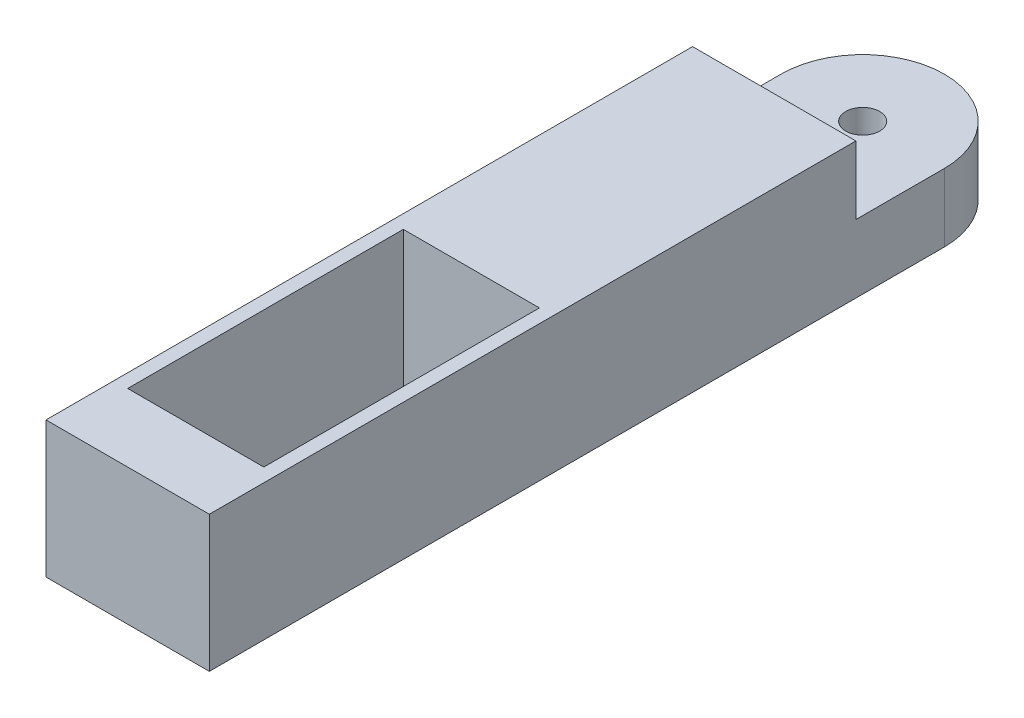
ISO-10303-21;
HEADER;
FILE_DESCRIPTION(('STEP AP214'),'2;1');
FILE_NAME('part.step','',(''),(''),'','','');
FILE_SCHEMA(('AUTOMOTIVE_DESIGN { 1 0 10303 214 1 1 1 1 }'));
ENDSEC;
DATA;
#1=APPLICATION_CONTEXT('core data for automotive mechanical design processes');
#2=APPLICATION_PROTOCOL_DEFINITION('international standard','automotive_design',2000,#1);
#3=PRODUCT_CONTEXT('',#1,'mechanical');
#4=PRODUCT('Part','Part','',(#3));
#5=PRODUCT_RELATED_PRODUCT_CATEGORY('part','',(#4));
#6=PRODUCT_DEFINITION_FORMATION('','',#4);
#7=PRODUCT_DEFINITION_CONTEXT('part definition',#1,'design');
#8=PRODUCT_DEFINITION('design','',#6,#7);
#9=PRODUCT_DEFINITION_SHAPE('','',#8);
#10=(LENGTH_UNIT() NAMED_UNIT(*) SI_UNIT(.MILLI.,.METRE.));
#11=(NAMED_UNIT(*) PLANE_ANGLE_UNIT() SI_UNIT($,.RADIAN.));
#12=(NAMED_UNIT(*) SI_UNIT($,.STERADIAN.) SOLID_ANGLE_UNIT());
#13=UNCERTAINTY_MEASURE_WITH_UNIT(LENGTH_MEASURE(1.E-05),#10,'distance_accuracy_value','');
#14=(GEOMETRIC_REPRESENTATION_CONTEXT(3) GLOBAL_UNCERTAINTY_ASSIGNED_CONTEXT((#13)) GLOBAL_UNIT_ASSIGNED_CONTEXT((#10,
#11,#12)) REPRESENTATION_CONTEXT('',''));
#15=CARTESIAN_POINT('',(0.,0.,0.));
#16=DIRECTION('',(0.,0.,1.));
#17=DIRECTION('',(1.,0.,0.));
#18=AXIS2_PLACEMENT_3D('',#15,#16,#17);
#19=CARTESIAN_POINT('',(-8.,10.,-20.));
#20=DIRECTION('',(0.,1.,0.));
#21=DIRECTION('',(0.,0.,1.));
#22=AXIS2_PLACEMENT_3D('',#19,#20,#21);
#23=PLANE('',#22);
#24=CARTESIAN_POINT('',(-8.,10.,-20.));
#25=DIRECTION('',(0.,1.,0.));
#26=DIRECTION('',(0.,0.,1.));
#27=AXIS2_PLACEMENT_3D('',#24,#25,#26);
#28=CIRCLE('',#27,12.);
#29=CARTESIAN_POINT('',(4.,10.,-20.));
#30=VERTEX_POINT('',#29);
#31=CARTESIAN_POINT('',(-20.,10.,-20.));
#32=VERTEX_POINT('',#31);
#33=EDGE_CURVE('E117',#30,#32,#28,.T.);
#34=ORIENTED_EDGE('',*,*,#33,.T.);
#35=DIRECTION('',(0.,0.,1.));
#36=VECTOR('',#35,1.);
#37=CARTESIAN_POINT('',(-20.,10.,-20.));
#38=LINE('',#37,#36);
#39=CARTESIAN_POINT('',(-20.,10.,-7.));
#40=VERTEX_POINT('',#39);
#41=EDGE_CURVE('E108',#32,#40,#38,.T.);
#42=ORIENTED_EDGE('',*,*,#41,.T.);
#43=DIRECTION('',(1.,0.,0.));
#44=VECTOR('',#43,1.);
#45=CARTESIAN_POINT('',(-20.,10.,-7.));
#46=LINE('',#45,#44);
#47=CARTESIAN_POINT('',(4.,10.,-7.));
#48=VERTEX_POINT('',#47);
#49=EDGE_CURVE('E99',#40,#48,#46,.T.);
#50=ORIENTED_EDGE('',*,*,#49,.T.);
#51=DIRECTION('',(0.,0.,1.));
#52=VECTOR('',#51,1.);
#53=CARTESIAN_POINT('',(4.,10.,-20.));
#54=LINE('',#53,#52);
#55=EDGE_CURVE('E121',#30,#48,#54,.T.);
#56=ORIENTED_EDGE('',*,*,#55,.F.);
#57=EDGE_LOOP('',(#34,#42,#50,#56));
#58=FACE_BOUND('',#57,.T.);
#59=CARTESIAN_POINT('',(-8.,10.,-20.));
#60=DIRECTION('',(0.,1.,0.));
#61=DIRECTION('',(0.,0.,1.));
#62=AXIS2_PLACEMENT_3D('',#59,#60,#61);
#63=CIRCLE('',#62,2.5);
#64=CARTESIAN_POINT('',(-8.,10.,-17.5));
#65=VERTEX_POINT('',#64);
#66=EDGE_CURVE('E129',#65,#65,#63,.T.);
#67=ORIENTED_EDGE('',*,*,#66,.F.);
#68=EDGE_LOOP('',(#67));
#69=FACE_BOUND('',#68,.T.);
#70=ADVANCED_FACE('F62',(#58,#69),#23,.T.);
#71=CARTESIAN_POINT('',(-8.,0.,-20.));
#72=DIRECTION('',(0.,1.,0.));
#73=DIRECTION('',(0.,0.,1.));
#74=AXIS2_PLACEMENT_3D('',#71,#72,#73);
#75=PLANE('',#74);
#76=CARTESIAN_POINT('',(-8.,0.,-20.));
#77=DIRECTION('',(0.,1.,0.));
#78=DIRECTION('',(0.,0.,1.));
#79=AXIS2_PLACEMENT_3D('',#76,#77,#78);
#80=CIRCLE('',#79,12.);
#81=CARTESIAN_POINT('',(4.,0.,-20.));
#82=VERTEX_POINT('',#81);
#83=CARTESIAN_POINT('',(-20.,0.,-20.));
#84=VERTEX_POINT('',#83);
#85=EDGE_CURVE('E126',#82,#84,#80,.T.);
#86=ORIENTED_EDGE('',*,*,#85,.F.);
#87=DIRECTION('',(0.,0.,1.));
#88=VECTOR('',#87,1.);
#89=CARTESIAN_POINT('',(4.,0.,-20.));
#90=LINE('',#89,#88);
#91=CARTESIAN_POINT('',(4.00000000000001,0.,88.));
#92=VERTEX_POINT('',#91);
#93=EDGE_CURVE('E124',#82,#92,#90,.T.);
#94=ORIENTED_EDGE('',*,*,#93,.T.);
#95=DIRECTION('',(1.,0.,0.));
#96=VECTOR('',#95,1.);
#97=CARTESIAN_POINT('',(-20.,0.,88.));
#98=LINE('',#97,#96);
#99=CARTESIAN_POINT('',(-20.,0.,88.));
#100=VERTEX_POINT('',#99);
#101=EDGE_CURVE('E154',#100,#92,#98,.T.);
#102=ORIENTED_EDGE('',*,*,#101,.F.);
#103=DIRECTION('',(0.,0.,1.));
#104=VECTOR('',#103,1.);
#105=CARTESIAN_POINT('',(-20.,0.,-20.));
#106=LINE('',#105,#104);
#107=EDGE_CURVE('E92',#84,#100,#106,.T.);
#108=ORIENTED_EDGE('',*,*,#107,.F.);
#109=EDGE_LOOP('',(#86,#94,#102,#108));
#110=FACE_BOUND('',#109,.T.);
#111=CARTESIAN_POINT('',(-8.,0.,-20.));
#112=DIRECTION('',(0.,1.,0.));
#113=DIRECTION('',(0.,0.,1.));
#114=AXIS2_PLACEMENT_3D('',#111,#112,#113);
#115=CIRCLE('',#114,2.5);
#116=CARTESIAN_POINT('',(-8.,0.,-17.5));
#117=VERTEX_POINT('',#116);
#118=EDGE_CURVE('E135',#117,#117,#115,.T.);
#119=ORIENTED_EDGE('',*,*,#118,.T.);
#120=EDGE_LOOP('',(#119));
#121=FACE_BOUND('',#120,.T.);
#122=DIRECTION('',(-1.,0.,0.));
#123=VECTOR('',#122,1.);
#124=CARTESIAN_POINT('',(2.00000000000001,0.,37.5));
#125=LINE('',#124,#123);
#126=CARTESIAN_POINT('',(2.00000000000001,0.,37.5));
#127=VERTEX_POINT('',#126);
#128=CARTESIAN_POINT('',(-18.,0.,37.5));
#129=VERTEX_POINT('',#128);
#130=EDGE_CURVE('E172',#127,#129,#125,.T.);
#131=ORIENTED_EDGE('',*,*,#130,.T.);
#132=DIRECTION('',(0.,0.,1.));
#133=VECTOR('',#132,1.);
#134=CARTESIAN_POINT('',(-18.,0.,37.5));
#135=LINE('',#134,#133);
#136=CARTESIAN_POINT('',(-18.,0.,78.));
#137=VERTEX_POINT('',#136);
#138=EDGE_CURVE('E194',#129,#137,#135,.T.);
#139=ORIENTED_EDGE('',*,*,#138,.T.);
#140=DIRECTION('',(1.,0.,0.));
#141=VECTOR('',#140,1.);
#142=CARTESIAN_POINT('',(-18.,0.,78.));
#143=LINE('',#142,#141);
#144=CARTESIAN_POINT('',(2.00000000000001,0.,78.));
#145=VERTEX_POINT('',#144);
#146=EDGE_CURVE('E190',#137,#145,#143,.T.);
#147=ORIENTED_EDGE('',*,*,#146,.T.);
#148=DIRECTION('',(0.,0.,-1.));
#149=VECTOR('',#148,1.);
#150=CARTESIAN_POINT('',(2.00000000000001,0.,78.));
#151=LINE('',#150,#149);
#152=EDGE_CURVE('E186',#145,#127,#151,.T.);
#153=ORIENTED_EDGE('',*,*,#152,.T.);
#154=EDGE_LOOP('',(#131,#139,#147,#153));
#155=FACE_BOUND('',#154,.T.);
#156=ADVANCED_FACE('F271',(#110,#121,#155),#75,.F.);
#157=CARTESIAN_POINT('',(-8.,10.,-20.));
#158=DIRECTION('',(0.,-1.,0.));
#159=DIRECTION('',(0.,0.,-1.));
#160=AXIS2_PLACEMENT_3D('',#157,#158,#159);
#161=CYLINDRICAL_SURFACE('',#160,12.);
#162=ORIENTED_EDGE('',*,*,#85,.T.);
#163=DIRECTION('',(0.,-1.,0.));
#164=VECTOR('',#163,1.);
#165=CARTESIAN_POINT('',(-20.,10.,-20.));
#166=LINE('',#165,#164);
#167=EDGE_CURVE('E12',#32,#84,#166,.T.);
#168=ORIENTED_EDGE('',*,*,#167,.F.);
#169=ORIENTED_EDGE('',*,*,#33,.F.);
#170=DIRECTION('',(0.,-1.,0.));
#171=VECTOR('',#170,1.);
#172=CARTESIAN_POINT('',(4.,10.,-20.));
#173=LINE('',#172,#171);
#174=EDGE_CURVE('E72',#30,#82,#173,.T.);
#175=ORIENTED_EDGE('',*,*,#174,.T.);
#176=EDGE_LOOP('',(#162,#168,#169,#175));
#177=FACE_BOUND('',#176,.T.);
#178=ADVANCED_FACE('F64',(#177),#161,.T.);
#179=CARTESIAN_POINT('',(-20.,10.,-20.));
#180=DIRECTION('',(1.,0.,0.));
#181=DIRECTION('',(0.,0.,-1.));
#182=AXIS2_PLACEMENT_3D('',#179,#180,#181);
#183=PLANE('',#182);
#184=ORIENTED_EDGE('',*,*,#107,.T.);
#185=DIRECTION('',(0.,1.,0.));
#186=VECTOR('',#185,1.);
#187=CARTESIAN_POINT('',(-20.,0.,88.));
#188=LINE('',#187,#186);
#189=CARTESIAN_POINT('',(-20.,20.,88.));
#190=VERTEX_POINT('',#189);
#191=EDGE_CURVE('E149',#100,#190,#188,.T.);
#192=ORIENTED_EDGE('',*,*,#191,.T.);
#193=DIRECTION('',(0.,0.,1.));
#194=VECTOR('',#193,1.);
#195=CARTESIAN_POINT('',(-20.,20.,-7.));
#196=LINE('',#195,#194);
#197=CARTESIAN_POINT('',(-20.,20.,-7.));
#198=VERTEX_POINT('',#197);
#199=EDGE_CURVE('E210',#198,#190,#196,.T.);
#200=ORIENTED_EDGE('',*,*,#199,.F.);
#201=DIRECTION('',(0.,1.,0.));
#202=VECTOR('',#201,1.);
#203=CARTESIAN_POINT('',(-20.,0.,-7.));
#204=LINE('',#203,#202);
#205=EDGE_CURVE('E114',#40,#198,#204,.T.);
#206=ORIENTED_EDGE('',*,*,#205,.F.);
#207=ORIENTED_EDGE('',*,*,#41,.F.);
#208=ORIENTED_EDGE('',*,*,#167,.T.);
#209=EDGE_LOOP('',(#184,#192,#200,#206,#207,#208));
#210=FACE_BOUND('',#209,.T.);
#211=ADVANCED_FACE('F110',(#210),#183,.F.);
#212=CARTESIAN_POINT('',(4.,10.,-20.));
#213=DIRECTION('',(1.,0.,0.));
#214=DIRECTION('',(0.,0.,-1.));
#215=AXIS2_PLACEMENT_3D('',#212,#213,#214);
#216=PLANE('',#215);
#217=ORIENTED_EDGE('',*,*,#93,.F.);
#218=ORIENTED_EDGE('',*,*,#174,.F.);
#219=ORIENTED_EDGE('',*,*,#55,.T.);
#220=DIRECTION('',(0.,1.,0.));
#221=VECTOR('',#220,1.);
#222=CARTESIAN_POINT('',(4.,0.,-7.));
#223=LINE('',#222,#221);
#224=CARTESIAN_POINT('',(4.,20.,-7.));
#225=VERTEX_POINT('',#224);
#226=EDGE_CURVE('E158',#48,#225,#223,.T.);
#227=ORIENTED_EDGE('',*,*,#226,.T.);
#228=DIRECTION('',(0.,0.,-1.));
#229=VECTOR('',#228,1.);
#230=CARTESIAN_POINT('',(4.,20.,-7.));
#231=LINE('',#230,#229);
#232=CARTESIAN_POINT('',(4.00000000000001,20.,88.));
#233=VERTEX_POINT('',#232);
#234=EDGE_CURVE('E202',#233,#225,#231,.T.);
#235=ORIENTED_EDGE('',*,*,#234,.F.);
#236=DIRECTION('',(0.,1.,0.));
#237=VECTOR('',#236,1.);
#238=CARTESIAN_POINT('',(4.00000000000001,0.,88.));
#239=LINE('',#238,#237);
#240=EDGE_CURVE('E153',#92,#233,#239,.T.);
#241=ORIENTED_EDGE('',*,*,#240,.F.);
#242=EDGE_LOOP('',(#217,#218,#219,#227,#235,#241));
#243=FACE_BOUND('',#242,.T.);
#244=ADVANCED_FACE('F274',(#243),#216,.T.);
#245=CARTESIAN_POINT('',(-8.,10.,-20.));
#246=DIRECTION('',(0.,-1.,0.));
#247=DIRECTION('',(0.,0.,-1.));
#248=AXIS2_PLACEMENT_3D('',#245,#246,#247);
#249=CYLINDRICAL_SURFACE('',#248,2.5);
#250=ORIENTED_EDGE('',*,*,#66,.T.);
#251=EDGE_LOOP('',(#250));
#252=FACE_BOUND('',#251,.T.);
#253=ORIENTED_EDGE('',*,*,#118,.F.);
#254=EDGE_LOOP('',(#253));
#255=FACE_BOUND('',#254,.T.);
#256=ADVANCED_FACE('F283',(#252,#255),#249,.F.);
#257=CARTESIAN_POINT('',(-20.,0.,-7.));
#258=DIRECTION('',(0.,0.,-1.));
#259=DIRECTION('',(-1.,0.,0.));
#260=AXIS2_PLACEMENT_3D('',#257,#258,#259);
#261=PLANE('',#260);
#262=ORIENTED_EDGE('',*,*,#49,.F.);
#263=ORIENTED_EDGE('',*,*,#205,.T.);
#264=DIRECTION('',(-1.,0.,0.));
#265=VECTOR('',#264,1.);
#266=CARTESIAN_POINT('',(-20.,20.,-7.));
#267=LINE('',#266,#265);
#268=EDGE_CURVE('E198',#225,#198,#267,.T.);
#269=ORIENTED_EDGE('',*,*,#268,.F.);
#270=ORIENTED_EDGE('',*,*,#226,.F.);
#271=EDGE_LOOP('',(#262,#263,#269,#270));
#272=FACE_BOUND('',#271,.T.);
#273=ADVANCED_FACE('F281',(#272),#261,.T.);
#274=CARTESIAN_POINT('',(-20.,0.,88.));
#275=DIRECTION('',(0.,0.,1.));
#276=DIRECTION('',(1.,0.,0.));
#277=AXIS2_PLACEMENT_3D('',#274,#275,#276);
#278=PLANE('',#277);
#279=ORIENTED_EDGE('',*,*,#240,.T.);
#280=DIRECTION('',(1.,0.,0.));
#281=VECTOR('',#280,1.);
#282=CARTESIAN_POINT('',(-20.,20.,88.));
#283=LINE('',#282,#281);
#284=EDGE_CURVE('E206',#190,#233,#283,.T.);
#285=ORIENTED_EDGE('',*,*,#284,.F.);
#286=ORIENTED_EDGE('',*,*,#191,.F.);
#287=ORIENTED_EDGE('',*,*,#101,.T.);
#288=EDGE_LOOP('',(#279,#285,#286,#287));
#289=FACE_BOUND('',#288,.T.);
#290=ADVANCED_FACE('F278',(#289),#278,.T.);
#291=CARTESIAN_POINT('',(-18.,0.,37.5));
#292=DIRECTION('',(-1.,0.,0.));
#293=DIRECTION('',(0.,0.,1.));
#294=AXIS2_PLACEMENT_3D('',#291,#292,#293);
#295=PLANE('',#294);
#296=DIRECTION('',(0.,1.,0.));
#297=VECTOR('',#296,1.);
#298=CARTESIAN_POINT('',(-18.,0.,37.5));
#299=LINE('',#298,#297);
#300=CARTESIAN_POINT('',(-18.,20.,37.5));
#301=VERTEX_POINT('',#300);
#302=EDGE_CURVE('E166',#129,#301,#299,.T.);
#303=ORIENTED_EDGE('',*,*,#302,.T.);
#304=DIRECTION('',(0.,0.,1.));
#305=VECTOR('',#304,1.);
#306=CARTESIAN_POINT('',(-18.,20.,37.5));
#307=LINE('',#306,#305);
#308=CARTESIAN_POINT('',(-18.,20.,78.));
#309=VERTEX_POINT('',#308);
#310=EDGE_CURVE('E226',#301,#309,#307,.T.);
#311=ORIENTED_EDGE('',*,*,#310,.T.);
#312=DIRECTION('',(0.,1.,0.));
#313=VECTOR('',#312,1.);
#314=CARTESIAN_POINT('',(-18.,0.,78.));
#315=LINE('',#314,#313);
#316=EDGE_CURVE('E167',#137,#309,#315,.T.);
#317=ORIENTED_EDGE('',*,*,#316,.F.);
#318=ORIENTED_EDGE('',*,*,#138,.F.);
#319=EDGE_LOOP('',(#303,#311,#317,#318));
#320=FACE_BOUND('',#319,.T.);
#321=ADVANCED_FACE('F234',(#320),#295,.F.);
#322=CARTESIAN_POINT('',(2.00000000000001,0.,37.5));
#323=DIRECTION('',(0.,0.,-1.));
#324=DIRECTION('',(-1.,0.,0.));
#325=AXIS2_PLACEMENT_3D('',#322,#323,#324);
#326=PLANE('',#325);
#327=DIRECTION('',(0.,1.,0.));
#328=VECTOR('',#327,1.);
#329=CARTESIAN_POINT('',(2.00000000000001,0.,37.5));
#330=LINE('',#329,#328);
#331=CARTESIAN_POINT('',(2.00000000000001,20.,37.5));
#332=VERTEX_POINT('',#331);
#333=EDGE_CURVE('E176',#127,#332,#330,.T.);
#334=ORIENTED_EDGE('',*,*,#333,.T.);
#335=DIRECTION('',(-1.,0.,0.));
#336=VECTOR('',#335,1.);
#337=CARTESIAN_POINT('',(2.00000000000001,20.,37.5));
#338=LINE('',#337,#336);
#339=EDGE_CURVE('E214',#332,#301,#338,.T.);
#340=ORIENTED_EDGE('',*,*,#339,.T.);
#341=ORIENTED_EDGE('',*,*,#302,.F.);
#342=ORIENTED_EDGE('',*,*,#130,.F.);
#343=EDGE_LOOP('',(#334,#340,#341,#342));
#344=FACE_BOUND('',#343,.T.);
#345=ADVANCED_FACE('F354',(#344),#326,.F.);
#346=CARTESIAN_POINT('',(2.00000000000001,0.,78.));
#347=DIRECTION('',(1.,0.,0.));
#348=DIRECTION('',(0.,0.,-1.));
#349=AXIS2_PLACEMENT_3D('',#346,#347,#348);
#350=PLANE('',#349);
#351=DIRECTION('',(0.,1.,0.));
#352=VECTOR('',#351,1.);
#353=CARTESIAN_POINT('',(2.00000000000001,0.,78.));
#354=LINE('',#353,#352);
#355=CARTESIAN_POINT('',(2.00000000000001,20.,78.));
#356=VERTEX_POINT('',#355);
#357=EDGE_CURVE('E171',#145,#356,#354,.T.);
#358=ORIENTED_EDGE('',*,*,#357,.T.);
#359=DIRECTION('',(0.,0.,-1.));
#360=VECTOR('',#359,1.);
#361=CARTESIAN_POINT('',(2.00000000000001,20.,78.));
#362=LINE('',#361,#360);
#363=EDGE_CURVE('E218',#356,#332,#362,.T.);
#364=ORIENTED_EDGE('',*,*,#363,.T.);
#365=ORIENTED_EDGE('',*,*,#333,.F.);
#366=ORIENTED_EDGE('',*,*,#152,.F.);
#367=EDGE_LOOP('',(#358,#364,#365,#366));
#368=FACE_BOUND('',#367,.T.);
#369=ADVANCED_FACE('F362',(#368),#350,.F.);
#370=CARTESIAN_POINT('',(-18.,0.,78.));
#371=DIRECTION('',(0.,0.,1.));
#372=DIRECTION('',(1.,0.,0.));
#373=AXIS2_PLACEMENT_3D('',#370,#371,#372);
#374=PLANE('',#373);
#375=ORIENTED_EDGE('',*,*,#316,.T.);
#376=DIRECTION('',(1.,0.,0.));
#377=VECTOR('',#376,1.);
#378=CARTESIAN_POINT('',(-18.,20.,78.));
#379=LINE('',#378,#377);
#380=EDGE_CURVE('E222',#309,#356,#379,.T.);
#381=ORIENTED_EDGE('',*,*,#380,.T.);
#382=ORIENTED_EDGE('',*,*,#357,.F.);
#383=ORIENTED_EDGE('',*,*,#146,.F.);
#384=EDGE_LOOP('',(#375,#381,#382,#383));
#385=FACE_BOUND('',#384,.T.);
#386=ADVANCED_FACE('F248',(#385),#374,.F.);
#387=CARTESIAN_POINT('',(0.,20.,0.));
#388=DIRECTION('',(0.,1.,0.));
#389=DIRECTION('',(0.,0.,1.));
#390=AXIS2_PLACEMENT_3D('',#387,#388,#389);
#391=PLANE('',#390);
#392=ORIENTED_EDGE('',*,*,#199,.T.);
#393=ORIENTED_EDGE('',*,*,#284,.T.);
#394=ORIENTED_EDGE('',*,*,#234,.T.);
#395=ORIENTED_EDGE('',*,*,#268,.T.);
#396=EDGE_LOOP('',(#392,#393,#394,#395));
#397=FACE_BOUND('',#396,.T.);
#398=ORIENTED_EDGE('',*,*,#380,.F.);
#399=ORIENTED_EDGE('',*,*,#310,.F.);
#400=ORIENTED_EDGE('',*,*,#339,.F.);
#401=ORIENTED_EDGE('',*,*,#363,.F.);
#402=EDGE_LOOP('',(#398,#399,#400,#401));
#403=FACE_BOUND('',#402,.T.);
#404=ADVANCED_FACE('F245',(#397,#403),#391,.T.);
#405=CLOSED_SHELL('',(#70,#156,#178,#211,#244,#256,#273,#290,#321,#345,#369,#386,#404));
#406=MANIFOLD_SOLID_BREP('B2',#405);
#407=ADVANCED_BREP_SHAPE_REPRESENTATION('',(#18,#406),#14);
#408=SHAPE_DEFINITION_REPRESENTATION(#9,#407);
ENDSEC;
END-ISO-10303-21;
